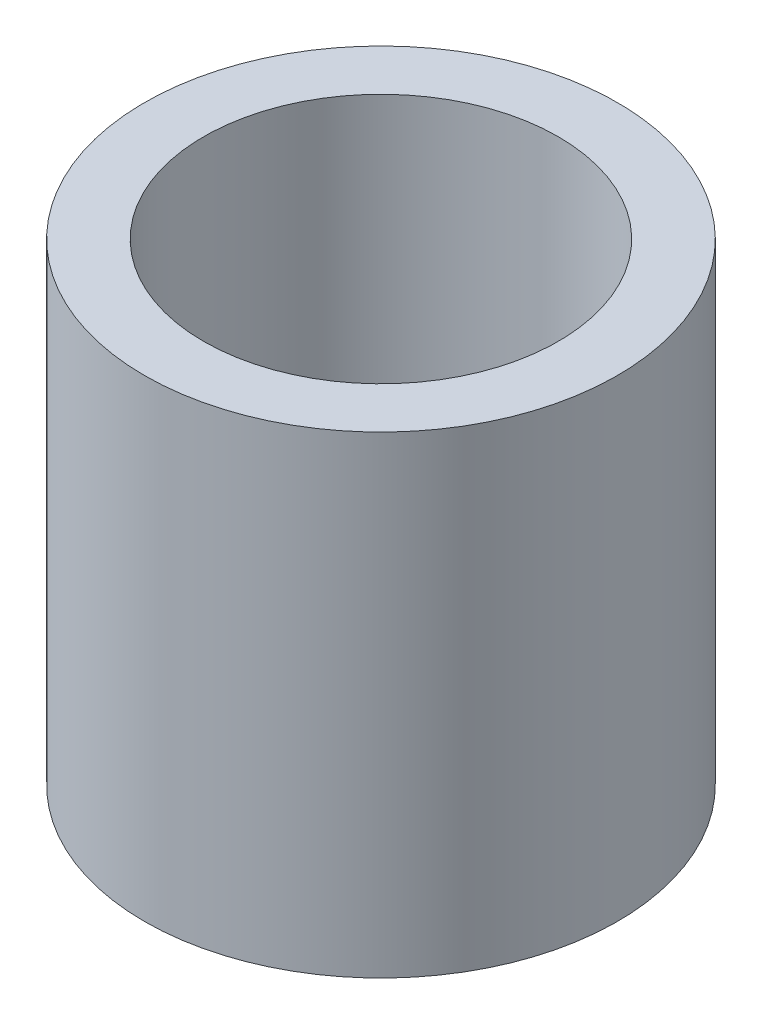
ISO-10303-21;
HEADER;
FILE_DESCRIPTION(('STEP AP214'),'2;1');
FILE_NAME('part.step','',(''),(''),'','','');
FILE_SCHEMA(('AUTOMOTIVE_DESIGN { 1 0 10303 214 1 1 1 1 }'));
ENDSEC;
DATA;
#1=APPLICATION_CONTEXT('core data for automotive mechanical design processes');
#2=APPLICATION_PROTOCOL_DEFINITION('international standard','automotive_design',2000,#1);
#3=PRODUCT_CONTEXT('',#1,'mechanical');
#4=PRODUCT('Part','Part','',(#3));
#5=PRODUCT_RELATED_PRODUCT_CATEGORY('part','',(#4));
#6=PRODUCT_DEFINITION_FORMATION('','',#4);
#7=PRODUCT_DEFINITION_CONTEXT('part definition',#1,'design');
#8=PRODUCT_DEFINITION('design','',#6,#7);
#9=PRODUCT_DEFINITION_SHAPE('','',#8);
#10=(LENGTH_UNIT() NAMED_UNIT(*) SI_UNIT(.MILLI.,.METRE.));
#11=(NAMED_UNIT(*) PLANE_ANGLE_UNIT() SI_UNIT($,.RADIAN.));
#12=(NAMED_UNIT(*) SI_UNIT($,.STERADIAN.) SOLID_ANGLE_UNIT());
#13=UNCERTAINTY_MEASURE_WITH_UNIT(LENGTH_MEASURE(1.E-05),#10,'distance_accuracy_value','');
#14=(GEOMETRIC_REPRESENTATION_CONTEXT(3) GLOBAL_UNCERTAINTY_ASSIGNED_CONTEXT((#13)) GLOBAL_UNIT_ASSIGNED_CONTEXT((#10,
#11,#12)) REPRESENTATION_CONTEXT('',''));
#15=CARTESIAN_POINT('',(0.,0.,0.));
#16=DIRECTION('',(0.,0.,1.));
#17=DIRECTION('',(1.,0.,0.));
#18=AXIS2_PLACEMENT_3D('',#15,#16,#17);
#19=CARTESIAN_POINT('',(0.,4.,0.));
#20=DIRECTION('',(0.,1.,0.));
#21=DIRECTION('',(0.,0.,1.));
#22=AXIS2_PLACEMENT_3D('',#19,#20,#21);
#23=PLANE('',#22);
#24=CARTESIAN_POINT('',(0.,4.,0.));
#25=DIRECTION('',(0.,1.,0.));
#26=DIRECTION('',(0.,0.,1.));
#27=AXIS2_PLACEMENT_3D('',#24,#25,#26);
#28=CIRCLE('',#27,2.);
#29=CARTESIAN_POINT('',(0.,4.,2.));
#30=VERTEX_POINT('',#29);
#31=EDGE_CURVE('E10',#30,#30,#28,.T.);
#32=ORIENTED_EDGE('',*,*,#31,.T.);
#33=EDGE_LOOP('',(#32));
#34=FACE_BOUND('',#33,.T.);
#35=CARTESIAN_POINT('',(0.,4.,0.));
#36=DIRECTION('',(0.,1.,0.));
#37=DIRECTION('',(0.,0.,1.));
#38=AXIS2_PLACEMENT_3D('',#35,#36,#37);
#39=CIRCLE('',#38,1.5);
#40=CARTESIAN_POINT('',(0.,4.,1.5));
#41=VERTEX_POINT('',#40);
#42=EDGE_CURVE('E56',#41,#41,#39,.T.);
#43=ORIENTED_EDGE('',*,*,#42,.F.);
#44=EDGE_LOOP('',(#43));
#45=FACE_BOUND('',#44,.T.);
#46=ADVANCED_FACE('F43',(#34,#45),#23,.T.);
#47=CARTESIAN_POINT('',(0.,0.,0.));
#48=DIRECTION('',(0.,1.,0.));
#49=DIRECTION('',(0.,0.,1.));
#50=AXIS2_PLACEMENT_3D('',#47,#48,#49);
#51=PLANE('',#50);
#52=CARTESIAN_POINT('',(0.,0.,0.));
#53=DIRECTION('',(0.,1.,0.));
#54=DIRECTION('',(0.,0.,1.));
#55=AXIS2_PLACEMENT_3D('',#52,#53,#54);
#56=CIRCLE('',#55,2.);
#57=CARTESIAN_POINT('',(0.,0.,2.));
#58=VERTEX_POINT('',#57);
#59=EDGE_CURVE('E47',#58,#58,#56,.T.);
#60=ORIENTED_EDGE('',*,*,#59,.F.);
#61=EDGE_LOOP('',(#60));
#62=FACE_BOUND('',#61,.T.);
#63=CARTESIAN_POINT('',(0.,0.,0.));
#64=DIRECTION('',(0.,1.,0.));
#65=DIRECTION('',(0.,0.,1.));
#66=AXIS2_PLACEMENT_3D('',#63,#64,#65);
#67=CIRCLE('',#66,1.5);
#68=CARTESIAN_POINT('',(0.,0.,1.5));
#69=VERTEX_POINT('',#68);
#70=EDGE_CURVE('E58',#69,#69,#67,.T.);
#71=ORIENTED_EDGE('',*,*,#70,.T.);
#72=EDGE_LOOP('',(#71));
#73=FACE_BOUND('',#72,.T.);
#74=ADVANCED_FACE('F70',(#62,#73),#51,.F.);
#75=CARTESIAN_POINT('',(0.,4.,0.));
#76=DIRECTION('',(0.,-1.,0.));
#77=DIRECTION('',(0.,0.,-1.));
#78=AXIS2_PLACEMENT_3D('',#75,#76,#77);
#79=CYLINDRICAL_SURFACE('',#78,2.);
#80=ORIENTED_EDGE('',*,*,#31,.F.);
#81=EDGE_LOOP('',(#80));
#82=FACE_BOUND('',#81,.T.);
#83=ORIENTED_EDGE('',*,*,#59,.T.);
#84=EDGE_LOOP('',(#83));
#85=FACE_BOUND('',#84,.T.);
#86=ADVANCED_FACE('F45',(#82,#85),#79,.T.);
#87=CARTESIAN_POINT('',(0.,4.,0.));
#88=DIRECTION('',(0.,-1.,0.));
#89=DIRECTION('',(0.,0.,-1.));
#90=AXIS2_PLACEMENT_3D('',#87,#88,#89);
#91=CYLINDRICAL_SURFACE('',#90,1.5);
#92=ORIENTED_EDGE('',*,*,#42,.T.);
#93=EDGE_LOOP('',(#92));
#94=FACE_BOUND('',#93,.T.);
#95=ORIENTED_EDGE('',*,*,#70,.F.);
#96=EDGE_LOOP('',(#95));
#97=FACE_BOUND('',#96,.T.);
#98=ADVANCED_FACE('F66',(#94,#97),#91,.F.);
#99=CLOSED_SHELL('',(#46,#74,#86,#98));
#100=MANIFOLD_SOLID_BREP('B2',#99);
#101=ADVANCED_BREP_SHAPE_REPRESENTATION('',(#18,#100),#14);
#102=SHAPE_DEFINITION_REPRESENTATION(#9,#101);
ENDSEC;
END-ISO-10303-21;
